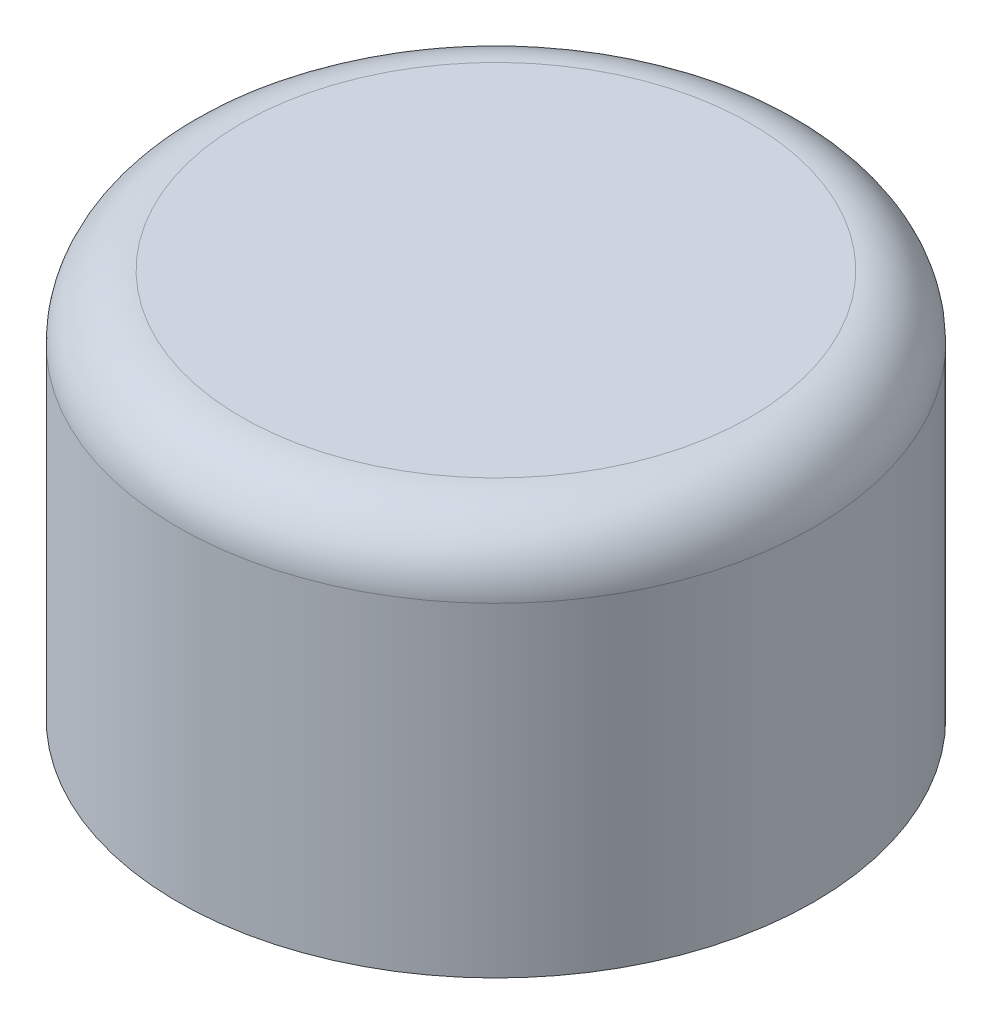
ISO-10303-21;
HEADER;
FILE_DESCRIPTION(('STEP AP214'),'2;1');
FILE_NAME('part.step','',(''),(''),'','','');
FILE_SCHEMA(('AUTOMOTIVE_DESIGN { 1 0 10303 214 1 1 1 1 }'));
ENDSEC;
DATA;
#1=APPLICATION_CONTEXT('core data for automotive mechanical design processes');
#2=APPLICATION_PROTOCOL_DEFINITION('international standard','automotive_design',2000,#1);
#3=PRODUCT_CONTEXT('',#1,'mechanical');
#4=PRODUCT('Part','Part','',(#3));
#5=PRODUCT_RELATED_PRODUCT_CATEGORY('part','',(#4));
#6=PRODUCT_DEFINITION_FORMATION('','',#4);
#7=PRODUCT_DEFINITION_CONTEXT('part definition',#1,'design');
#8=PRODUCT_DEFINITION('design','',#6,#7);
#9=PRODUCT_DEFINITION_SHAPE('','',#8);
#10=(LENGTH_UNIT() NAMED_UNIT(*) SI_UNIT(.MILLI.,.METRE.));
#11=(NAMED_UNIT(*) PLANE_ANGLE_UNIT() SI_UNIT($,.RADIAN.));
#12=(NAMED_UNIT(*) SI_UNIT($,.STERADIAN.) SOLID_ANGLE_UNIT());
#13=UNCERTAINTY_MEASURE_WITH_UNIT(LENGTH_MEASURE(1.E-05),#10,'distance_accuracy_value','');
#14=(GEOMETRIC_REPRESENTATION_CONTEXT(3) GLOBAL_UNCERTAINTY_ASSIGNED_CONTEXT((#13)) GLOBAL_UNIT_ASSIGNED_CONTEXT((#10,
#11,#12)) REPRESENTATION_CONTEXT('',''));
#15=CARTESIAN_POINT('',(0.,0.,0.));
#16=DIRECTION('',(0.,0.,1.));
#17=DIRECTION('',(1.,0.,0.));
#18=AXIS2_PLACEMENT_3D('',#15,#16,#17);
#19=CARTESIAN_POINT('',(0.,12.954,0.));
#20=DIRECTION('',(0.,1.,0.));
#21=DIRECTION('',(-1.,0.,0.));
#22=AXIS2_PLACEMENT_3D('',#19,#20,#21);
#23=PLANE('',#22);
#24=CARTESIAN_POINT('',(0.,12.954,0.));
#25=DIRECTION('',(0.,-1.,0.));
#26=DIRECTION('',(1.,0.,0.));
#27=AXIS2_PLACEMENT_3D('',#24,#25,#26);
#28=CIRCLE('',#27,10.16);
#29=CARTESIAN_POINT('',(10.16,12.954,0.));
#30=VERTEX_POINT('',#29);
#31=EDGE_CURVE('E10',#30,#30,#28,.T.);
#32=ORIENTED_EDGE('',*,*,#31,.T.);
#33=EDGE_LOOP('',(#32));
#34=FACE_BOUND('',#33,.T.);
#35=ADVANCED_FACE('F33',(#34),#23,.F.);
#36=CARTESIAN_POINT('',(0.,0.,0.));
#37=DIRECTION('',(0.,-1.,0.));
#38=DIRECTION('',(1.,0.,0.));
#39=AXIS2_PLACEMENT_3D('',#36,#37,#38);
#40=CYLINDRICAL_SURFACE('',#39,10.16);
#41=ORIENTED_EDGE('',*,*,#31,.F.);
#42=EDGE_LOOP('',(#41));
#43=FACE_BOUND('',#42,.T.);
#44=CARTESIAN_POINT('',(0.,0.,0.));
#45=DIRECTION('',(0.,-1.,0.));
#46=DIRECTION('',(1.,0.,0.));
#47=AXIS2_PLACEMENT_3D('',#44,#45,#46);
#48=CIRCLE('',#47,10.16);
#49=CARTESIAN_POINT('',(10.16,0.,0.));
#50=VERTEX_POINT('',#49);
#51=EDGE_CURVE('E39',#50,#50,#48,.T.);
#52=ORIENTED_EDGE('',*,*,#51,.T.);
#53=EDGE_LOOP('',(#52));
#54=FACE_BOUND('',#53,.T.);
#55=ADVANCED_FACE('F68',(#43,#54),#40,.F.);
#56=CARTESIAN_POINT('',(-10.16,0.,0.));
#57=DIRECTION('',(0.,1.,0.));
#58=DIRECTION('',(-1.,0.,0.));
#59=AXIS2_PLACEMENT_3D('',#56,#57,#58);
#60=PLANE('',#59);
#61=ORIENTED_EDGE('',*,*,#51,.F.);
#62=EDGE_LOOP('',(#61));
#63=FACE_BOUND('',#62,.T.);
#64=CARTESIAN_POINT('',(0.,0.,0.));
#65=DIRECTION('',(0.,-1.,0.));
#66=DIRECTION('',(1.,0.,0.));
#67=AXIS2_PLACEMENT_3D('',#64,#65,#66);
#68=CIRCLE('',#67,12.7);
#69=CARTESIAN_POINT('',(12.7,0.,0.));
#70=VERTEX_POINT('',#69);
#71=EDGE_CURVE('E43',#70,#70,#68,.T.);
#72=ORIENTED_EDGE('',*,*,#71,.T.);
#73=EDGE_LOOP('',(#72));
#74=FACE_BOUND('',#73,.T.);
#75=ADVANCED_FACE('F72',(#63,#74),#60,.F.);
#76=CARTESIAN_POINT('',(0.,0.,0.));
#77=DIRECTION('',(0.,-1.,0.));
#78=DIRECTION('',(1.,0.,0.));
#79=AXIS2_PLACEMENT_3D('',#76,#77,#78);
#80=CYLINDRICAL_SURFACE('',#79,12.7);
#81=ORIENTED_EDGE('',*,*,#71,.F.);
#82=EDGE_LOOP('',(#81));
#83=FACE_BOUND('',#82,.T.);
#84=CARTESIAN_POINT('',(0.,12.954,0.));
#85=DIRECTION('',(0.,-1.,0.));
#86=DIRECTION('',(1.,0.,0.));
#87=AXIS2_PLACEMENT_3D('',#84,#85,#86);
#88=CIRCLE('',#87,12.7);
#89=CARTESIAN_POINT('',(12.7,12.954,0.));
#90=VERTEX_POINT('',#89);
#91=EDGE_CURVE('E47',#90,#90,#88,.T.);
#92=ORIENTED_EDGE('',*,*,#91,.T.);
#93=EDGE_LOOP('',(#92));
#94=FACE_BOUND('',#93,.T.);
#95=ADVANCED_FACE('F64',(#83,#94),#80,.T.);
#96=CARTESIAN_POINT('',(0.,12.954,0.));
#97=DIRECTION('',(0.,-1.,0.));
#98=DIRECTION('',(1.,0.,0.));
#99=AXIS2_PLACEMENT_3D('',#96,#97,#98);
#100=TOROIDAL_SURFACE('',#99,10.16,2.54);
#101=ORIENTED_EDGE('',*,*,#91,.F.);
#102=EDGE_LOOP('',(#101));
#103=FACE_BOUND('',#102,.T.);
#104=CARTESIAN_POINT('',(0.,15.494,0.));
#105=DIRECTION('',(0.,-1.,0.));
#106=DIRECTION('',(1.,0.,0.));
#107=AXIS2_PLACEMENT_3D('',#104,#105,#106);
#108=CIRCLE('',#107,10.16);
#109=CARTESIAN_POINT('',(10.16,15.494,0.));
#110=VERTEX_POINT('',#109);
#111=EDGE_CURVE('E52',#110,#110,#108,.T.);
#112=ORIENTED_EDGE('',*,*,#111,.T.);
#113=EDGE_LOOP('',(#112));
#114=FACE_BOUND('',#113,.T.);
#115=ADVANCED_FACE('F56',(#103,#114),#100,.T.);
#116=CARTESIAN_POINT('',(-10.16,15.494,0.));
#117=DIRECTION('',(0.,-1.,0.));
#118=DIRECTION('',(1.,0.,0.));
#119=AXIS2_PLACEMENT_3D('',#116,#117,#118);
#120=PLANE('',#119);
#121=ORIENTED_EDGE('',*,*,#111,.F.);
#122=EDGE_LOOP('',(#121));
#123=FACE_BOUND('',#122,.T.);
#124=ADVANCED_FACE('F58',(#123),#120,.F.);
#125=CLOSED_SHELL('',(#35,#55,#75,#95,#115,#124));
#126=MANIFOLD_SOLID_BREP('B2',#125);
#127=ADVANCED_BREP_SHAPE_REPRESENTATION('',(#18,#126),#14);
#128=SHAPE_DEFINITION_REPRESENTATION(#9,#127);
ENDSEC;
END-ISO-10303-21;
